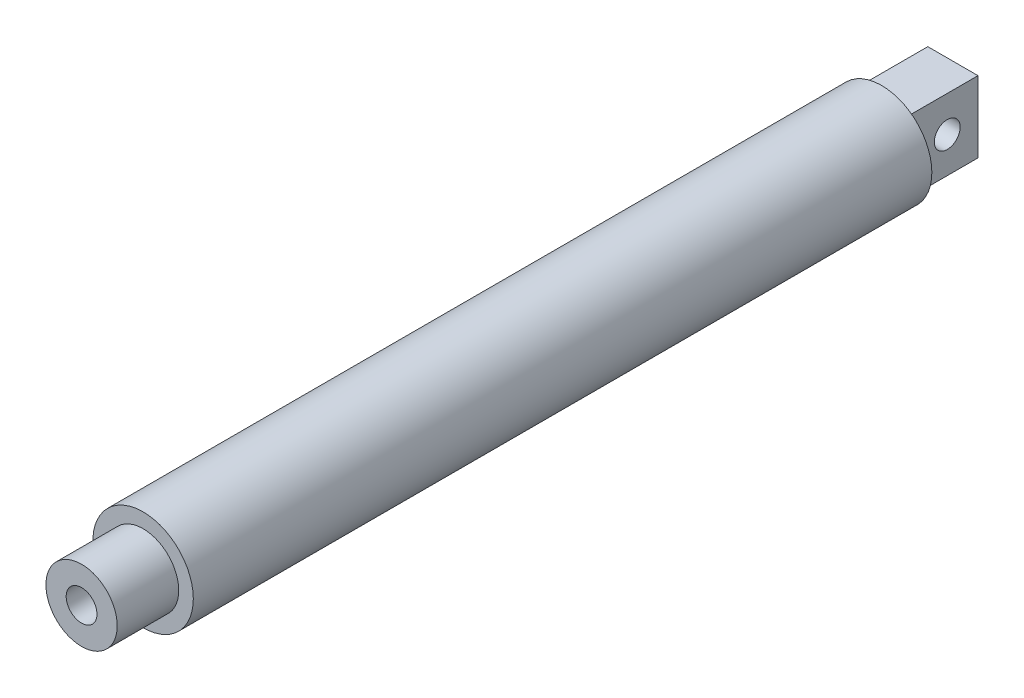
ISO-10303-21;
HEADER;
FILE_DESCRIPTION(('STEP AP214'),'2;1');
FILE_NAME('part.step','',(''),(''),'','','');
FILE_SCHEMA(('AUTOMOTIVE_DESIGN { 1 0 10303 214 1 1 1 1 }'));
ENDSEC;
DATA;
#1=APPLICATION_CONTEXT('core data for automotive mechanical design processes');
#2=APPLICATION_PROTOCOL_DEFINITION('international standard','automotive_design',2000,#1);
#3=PRODUCT_CONTEXT('',#1,'mechanical');
#4=PRODUCT('Part','Part','',(#3));
#5=PRODUCT_RELATED_PRODUCT_CATEGORY('part','',(#4));
#6=PRODUCT_DEFINITION_FORMATION('','',#4);
#7=PRODUCT_DEFINITION_CONTEXT('part definition',#1,'design');
#8=PRODUCT_DEFINITION('design','',#6,#7);
#9=PRODUCT_DEFINITION_SHAPE('','',#8);
#10=(LENGTH_UNIT() NAMED_UNIT(*) SI_UNIT(.MILLI.,.METRE.));
#11=(NAMED_UNIT(*) PLANE_ANGLE_UNIT() SI_UNIT($,.RADIAN.));
#12=(NAMED_UNIT(*) SI_UNIT($,.STERADIAN.) SOLID_ANGLE_UNIT());
#13=UNCERTAINTY_MEASURE_WITH_UNIT(LENGTH_MEASURE(1.E-05),#10,'distance_accuracy_value','');
#14=(GEOMETRIC_REPRESENTATION_CONTEXT(3) GLOBAL_UNCERTAINTY_ASSIGNED_CONTEXT((#13)) GLOBAL_UNIT_ASSIGNED_CONTEXT((#10,
#11,#12)) REPRESENTATION_CONTEXT('',''));
#15=CARTESIAN_POINT('',(0.,0.,0.));
#16=DIRECTION('',(0.,0.,1.));
#17=DIRECTION('',(1.,0.,0.));
#18=AXIS2_PLACEMENT_3D('',#15,#16,#17);
#19=CARTESIAN_POINT('',(0.,0.,0.));
#20=DIRECTION('',(0.,0.,1.));
#21=DIRECTION('',(1.,0.,0.));
#22=AXIS2_PLACEMENT_3D('',#19,#20,#21);
#23=PLANE('',#22);
#24=CARTESIAN_POINT('',(0.,0.,0.));
#25=DIRECTION('',(0.,0.,1.));
#26=DIRECTION('',(1.,0.,0.));
#27=AXIS2_PLACEMENT_3D('',#24,#25,#26);
#28=CIRCLE('',#27,7.874);
#29=CARTESIAN_POINT('',(7.874,0.,0.));
#30=VERTEX_POINT('',#29);
#31=EDGE_CURVE('E36',#30,#30,#28,.T.);
#32=ORIENTED_EDGE('',*,*,#31,.F.);
#33=EDGE_LOOP('',(#32));
#34=FACE_BOUND('',#33,.T.);
#35=DIRECTION('',(0.,1.,0.));
#36=VECTOR('',#35,1.);
#37=CARTESIAN_POINT('',(-3.937,-5.588,0.));
#38=LINE('',#37,#36);
#39=CARTESIAN_POINT('',(-3.937,-5.588,0.));
#40=VERTEX_POINT('',#39);
#41=CARTESIAN_POINT('',(-3.937,5.588,0.));
#42=VERTEX_POINT('',#41);
#43=EDGE_CURVE('E49',#40,#42,#38,.T.);
#44=ORIENTED_EDGE('',*,*,#43,.F.);
#45=DIRECTION('',(-1.,0.,0.));
#46=VECTOR('',#45,1.);
#47=CARTESIAN_POINT('',(3.937,-5.588,0.));
#48=LINE('',#47,#46);
#49=CARTESIAN_POINT('',(3.937,-5.588,0.));
#50=VERTEX_POINT('',#49);
#51=EDGE_CURVE('E53',#50,#40,#48,.T.);
#52=ORIENTED_EDGE('',*,*,#51,.F.);
#53=DIRECTION('',(0.,-1.,0.));
#54=VECTOR('',#53,1.);
#55=CARTESIAN_POINT('',(3.937,-5.588,0.));
#56=LINE('',#55,#54);
#57=CARTESIAN_POINT('',(3.937,5.588,0.));
#58=VERTEX_POINT('',#57);
#59=EDGE_CURVE('E175',#58,#50,#56,.T.);
#60=ORIENTED_EDGE('',*,*,#59,.F.);
#61=DIRECTION('',(1.,0.,0.));
#62=VECTOR('',#61,1.);
#63=CARTESIAN_POINT('',(3.937,5.588,0.));
#64=LINE('',#63,#62);
#65=EDGE_CURVE('E173',#42,#58,#64,.T.);
#66=ORIENTED_EDGE('',*,*,#65,.F.);
#67=EDGE_LOOP('',(#44,#52,#60,#66));
#68=FACE_BOUND('',#67,.T.);
#69=ADVANCED_FACE('F32',(#34,#68),#23,.F.);
#70=CARTESIAN_POINT('',(0.,0.,115.824));
#71=DIRECTION('',(0.,0.,-1.));
#72=DIRECTION('',(-1.,0.,0.));
#73=AXIS2_PLACEMENT_3D('',#70,#71,#72);
#74=CYLINDRICAL_SURFACE('',#73,7.874);
#75=CARTESIAN_POINT('',(0.,0.,115.824));
#76=DIRECTION('',(0.,0.,1.));
#77=DIRECTION('',(1.,0.,0.));
#78=AXIS2_PLACEMENT_3D('',#75,#76,#77);
#79=CIRCLE('',#78,7.874);
#80=CARTESIAN_POINT('',(7.874,0.,115.824));
#81=VERTEX_POINT('',#80);
#82=EDGE_CURVE('E41',#81,#81,#79,.T.);
#83=ORIENTED_EDGE('',*,*,#82,.F.);
#84=EDGE_LOOP('',(#83));
#85=FACE_BOUND('',#84,.T.);
#86=ORIENTED_EDGE('',*,*,#31,.T.);
#87=EDGE_LOOP('',(#86));
#88=FACE_BOUND('',#87,.T.);
#89=ADVANCED_FACE('F34',(#85,#88),#74,.T.);
#90=CARTESIAN_POINT('',(0.,0.,115.824));
#91=DIRECTION('',(0.,0.,1.));
#92=DIRECTION('',(1.,0.,0.));
#93=AXIS2_PLACEMENT_3D('',#90,#91,#92);
#94=PLANE('',#93);
#95=CARTESIAN_POINT('',(0.,0.,115.824));
#96=DIRECTION('',(0.,0.,1.));
#97=DIRECTION('',(1.,0.,0.));
#98=AXIS2_PLACEMENT_3D('',#95,#96,#97);
#99=CIRCLE('',#98,5.588);
#100=CARTESIAN_POINT('',(5.588,0.,115.824));
#101=VERTEX_POINT('',#100);
#102=EDGE_CURVE('E11',#101,#101,#99,.T.);
#103=ORIENTED_EDGE('',*,*,#102,.F.);
#104=EDGE_LOOP('',(#103));
#105=FACE_BOUND('',#104,.T.);
#106=ORIENTED_EDGE('',*,*,#82,.T.);
#107=EDGE_LOOP('',(#106));
#108=FACE_BOUND('',#107,.T.);
#109=ADVANCED_FACE('F113',(#105,#108),#94,.T.);
#110=CARTESIAN_POINT('',(0.,0.,125.476));
#111=DIRECTION('',(0.,0.,-1.));
#112=DIRECTION('',(-1.,0.,0.));
#113=AXIS2_PLACEMENT_3D('',#110,#111,#112);
#114=CYLINDRICAL_SURFACE('',#113,5.588);
#115=CARTESIAN_POINT('',(0.,0.,125.476));
#116=DIRECTION('',(0.,0.,1.));
#117=DIRECTION('',(1.,0.,0.));
#118=AXIS2_PLACEMENT_3D('',#115,#116,#117);
#119=CIRCLE('',#118,5.588);
#120=CARTESIAN_POINT('',(5.588,0.,125.476));
#121=VERTEX_POINT('',#120);
#122=EDGE_CURVE('E95',#121,#121,#119,.T.);
#123=ORIENTED_EDGE('',*,*,#122,.F.);
#124=EDGE_LOOP('',(#123));
#125=FACE_BOUND('',#124,.T.);
#126=ORIENTED_EDGE('',*,*,#102,.T.);
#127=EDGE_LOOP('',(#126));
#128=FACE_BOUND('',#127,.T.);
#129=ADVANCED_FACE('F118',(#125,#128),#114,.T.);
#130=CARTESIAN_POINT('',(0.,0.,125.476));
#131=DIRECTION('',(0.,0.,1.));
#132=DIRECTION('',(1.,0.,0.));
#133=AXIS2_PLACEMENT_3D('',#130,#131,#132);
#134=PLANE('',#133);
#135=CARTESIAN_POINT('',(0.,0.,125.476));
#136=DIRECTION('',(0.,0.,1.));
#137=DIRECTION('',(1.,0.,0.));
#138=AXIS2_PLACEMENT_3D('',#135,#136,#137);
#139=CIRCLE('',#138,2.413);
#140=CARTESIAN_POINT('',(2.413,0.,125.476));
#141=VERTEX_POINT('',#140);
#142=EDGE_CURVE('E159',#141,#141,#139,.T.);
#143=ORIENTED_EDGE('',*,*,#142,.F.);
#144=EDGE_LOOP('',(#143));
#145=FACE_BOUND('',#144,.T.);
#146=ORIENTED_EDGE('',*,*,#122,.T.);
#147=EDGE_LOOP('',(#146));
#148=FACE_BOUND('',#147,.T.);
#149=ADVANCED_FACE('F122',(#145,#148),#134,.T.);
#150=CARTESIAN_POINT('',(-3.937,-5.588,-11.176));
#151=DIRECTION('',(1.,0.,0.));
#152=DIRECTION('',(0.,0.,-1.));
#153=AXIS2_PLACEMENT_3D('',#150,#151,#152);
#154=PLANE('',#153);
#155=CARTESIAN_POINT('',(-3.937,0.,-6.35));
#156=DIRECTION('',(1.,0.,0.));
#157=DIRECTION('',(0.,0.,-1.));
#158=AXIS2_PLACEMENT_3D('',#155,#156,#157);
#159=CIRCLE('',#158,2.032);
#160=CARTESIAN_POINT('',(-3.937,0.,-8.382));
#161=VERTEX_POINT('',#160);
#162=EDGE_CURVE('E162',#161,#161,#159,.T.);
#163=ORIENTED_EDGE('',*,*,#162,.T.);
#164=EDGE_LOOP('',(#163));
#165=FACE_BOUND('',#164,.T.);
#166=ORIENTED_EDGE('',*,*,#43,.T.);
#167=DIRECTION('',(0.,0.,1.));
#168=VECTOR('',#167,1.);
#169=CARTESIAN_POINT('',(-3.937,5.588,-11.176));
#170=LINE('',#169,#168);
#171=CARTESIAN_POINT('',(-3.937,5.588,-11.176));
#172=VERTEX_POINT('',#171);
#173=EDGE_CURVE('E78',#172,#42,#170,.T.);
#174=ORIENTED_EDGE('',*,*,#173,.F.);
#175=DIRECTION('',(0.,1.,0.));
#176=VECTOR('',#175,1.);
#177=CARTESIAN_POINT('',(-3.937,-5.588,-11.176));
#178=LINE('',#177,#176);
#179=CARTESIAN_POINT('',(-3.937,-5.588,-11.176));
#180=VERTEX_POINT('',#179);
#181=EDGE_CURVE('E84',#180,#172,#178,.T.);
#182=ORIENTED_EDGE('',*,*,#181,.F.);
#183=DIRECTION('',(0.,0.,1.));
#184=VECTOR('',#183,1.);
#185=CARTESIAN_POINT('',(-3.937,-5.588,-11.176));
#186=LINE('',#185,#184);
#187=EDGE_CURVE('E171',#180,#40,#186,.T.);
#188=ORIENTED_EDGE('',*,*,#187,.T.);
#189=EDGE_LOOP('',(#166,#174,#182,#188));
#190=FACE_BOUND('',#189,.T.);
#191=ADVANCED_FACE('F94',(#165,#190),#154,.F.);
#192=CARTESIAN_POINT('',(3.937,5.588,-11.176));
#193=DIRECTION('',(0.,-1.,0.));
#194=DIRECTION('',(0.,0.,-1.));
#195=AXIS2_PLACEMENT_3D('',#192,#193,#194);
#196=PLANE('',#195);
#197=ORIENTED_EDGE('',*,*,#65,.T.);
#198=DIRECTION('',(0.,0.,1.));
#199=VECTOR('',#198,1.);
#200=CARTESIAN_POINT('',(3.937,5.588,-11.176));
#201=LINE('',#200,#199);
#202=CARTESIAN_POINT('',(3.937,5.588,-11.176));
#203=VERTEX_POINT('',#202);
#204=EDGE_CURVE('E80',#203,#58,#201,.T.);
#205=ORIENTED_EDGE('',*,*,#204,.F.);
#206=DIRECTION('',(1.,0.,0.));
#207=VECTOR('',#206,1.);
#208=CARTESIAN_POINT('',(3.937,5.588,-11.176));
#209=LINE('',#208,#207);
#210=EDGE_CURVE('E73',#172,#203,#209,.T.);
#211=ORIENTED_EDGE('',*,*,#210,.F.);
#212=ORIENTED_EDGE('',*,*,#173,.T.);
#213=EDGE_LOOP('',(#197,#205,#211,#212));
#214=FACE_BOUND('',#213,.T.);
#215=ADVANCED_FACE('F76',(#214),#196,.F.);
#216=CARTESIAN_POINT('',(3.937,-5.588,-11.176));
#217=DIRECTION('',(-1.,0.,0.));
#218=DIRECTION('',(0.,0.,1.));
#219=AXIS2_PLACEMENT_3D('',#216,#217,#218);
#220=PLANE('',#219);
#221=CARTESIAN_POINT('',(3.937,0.,-6.35));
#222=DIRECTION('',(1.,0.,0.));
#223=DIRECTION('',(0.,0.,-1.));
#224=AXIS2_PLACEMENT_3D('',#221,#222,#223);
#225=CIRCLE('',#224,2.032);
#226=CARTESIAN_POINT('',(3.937,0.,-8.382));
#227=VERTEX_POINT('',#226);
#228=EDGE_CURVE('E158',#227,#227,#225,.T.);
#229=ORIENTED_EDGE('',*,*,#228,.F.);
#230=EDGE_LOOP('',(#229));
#231=FACE_BOUND('',#230,.T.);
#232=ORIENTED_EDGE('',*,*,#59,.T.);
#233=DIRECTION('',(0.,0.,1.));
#234=VECTOR('',#233,1.);
#235=CARTESIAN_POINT('',(3.937,-5.588,-11.176));
#236=LINE('',#235,#234);
#237=CARTESIAN_POINT('',(3.937,-5.588,-11.176));
#238=VERTEX_POINT('',#237);
#239=EDGE_CURVE('E99',#238,#50,#236,.T.);
#240=ORIENTED_EDGE('',*,*,#239,.F.);
#241=DIRECTION('',(0.,-1.,0.));
#242=VECTOR('',#241,1.);
#243=CARTESIAN_POINT('',(3.937,-5.588,-11.176));
#244=LINE('',#243,#242);
#245=EDGE_CURVE('E83',#203,#238,#244,.T.);
#246=ORIENTED_EDGE('',*,*,#245,.F.);
#247=ORIENTED_EDGE('',*,*,#204,.T.);
#248=EDGE_LOOP('',(#232,#240,#246,#247));
#249=FACE_BOUND('',#248,.T.);
#250=ADVANCED_FACE('F132',(#231,#249),#220,.F.);
#251=CARTESIAN_POINT('',(3.937,-5.588,-11.176));
#252=DIRECTION('',(0.,1.,0.));
#253=DIRECTION('',(0.,0.,1.));
#254=AXIS2_PLACEMENT_3D('',#251,#252,#253);
#255=PLANE('',#254);
#256=ORIENTED_EDGE('',*,*,#51,.T.);
#257=ORIENTED_EDGE('',*,*,#187,.F.);
#258=DIRECTION('',(-1.,0.,0.));
#259=VECTOR('',#258,1.);
#260=CARTESIAN_POINT('',(3.937,-5.588,-11.176));
#261=LINE('',#260,#259);
#262=EDGE_CURVE('E89',#238,#180,#261,.T.);
#263=ORIENTED_EDGE('',*,*,#262,.F.);
#264=ORIENTED_EDGE('',*,*,#239,.T.);
#265=EDGE_LOOP('',(#256,#257,#263,#264));
#266=FACE_BOUND('',#265,.T.);
#267=ADVANCED_FACE('F135',(#266),#255,.F.);
#268=CARTESIAN_POINT('',(0.,0.,-11.176));
#269=DIRECTION('',(0.,0.,1.));
#270=DIRECTION('',(1.,0.,0.));
#271=AXIS2_PLACEMENT_3D('',#268,#269,#270);
#272=PLANE('',#271);
#273=ORIENTED_EDGE('',*,*,#181,.T.);
#274=ORIENTED_EDGE('',*,*,#210,.T.);
#275=ORIENTED_EDGE('',*,*,#245,.T.);
#276=ORIENTED_EDGE('',*,*,#262,.T.);
#277=EDGE_LOOP('',(#273,#274,#275,#276));
#278=FACE_BOUND('',#277,.T.);
#279=ADVANCED_FACE('F87',(#278),#272,.F.);
#280=CARTESIAN_POINT('',(-7.874,0.,-6.35));
#281=DIRECTION('',(1.,0.,0.));
#282=DIRECTION('',(0.,0.,-1.));
#283=AXIS2_PLACEMENT_3D('',#280,#281,#282);
#284=CYLINDRICAL_SURFACE('',#283,2.032);
#285=ORIENTED_EDGE('',*,*,#228,.T.);
#286=EDGE_LOOP('',(#285));
#287=FACE_BOUND('',#286,.T.);
#288=ORIENTED_EDGE('',*,*,#162,.F.);
#289=EDGE_LOOP('',(#288));
#290=FACE_BOUND('',#289,.T.);
#291=ADVANCED_FACE('F142',(#287,#290),#284,.F.);
#292=CARTESIAN_POINT('',(0.,0.,11.176));
#293=DIRECTION('',(0.,0.,1.));
#294=DIRECTION('',(1.,0.,0.));
#295=AXIS2_PLACEMENT_3D('',#292,#293,#294);
#296=CYLINDRICAL_SURFACE('',#295,2.413);
#297=CARTESIAN_POINT('',(0.,0.,11.176));
#298=DIRECTION('',(0.,0.,1.));
#299=DIRECTION('',(1.,0.,0.));
#300=AXIS2_PLACEMENT_3D('',#297,#298,#299);
#301=CIRCLE('',#300,2.413);
#302=CARTESIAN_POINT('',(2.413,0.,11.176));
#303=VERTEX_POINT('',#302);
#304=EDGE_CURVE('E157',#303,#303,#301,.T.);
#305=ORIENTED_EDGE('',*,*,#304,.F.);
#306=EDGE_LOOP('',(#305));
#307=FACE_BOUND('',#306,.T.);
#308=ORIENTED_EDGE('',*,*,#142,.T.);
#309=EDGE_LOOP('',(#308));
#310=FACE_BOUND('',#309,.T.);
#311=ADVANCED_FACE('F145',(#307,#310),#296,.F.);
#312=CARTESIAN_POINT('',(0.,0.,11.176));
#313=DIRECTION('',(0.,0.,1.));
#314=DIRECTION('',(1.,0.,0.));
#315=AXIS2_PLACEMENT_3D('',#312,#313,#314);
#316=PLANE('',#315);
#317=ORIENTED_EDGE('',*,*,#304,.T.);
#318=EDGE_LOOP('',(#317));
#319=FACE_BOUND('',#318,.T.);
#320=ADVANCED_FACE('F149',(#319),#316,.T.);
#321=CLOSED_SHELL('',(#69,#89,#109,#129,#149,#191,#215,#250,#267,#279,#291,#311,#320));
#322=MANIFOLD_SOLID_BREP('B2',#321);
#323=ADVANCED_BREP_SHAPE_REPRESENTATION('',(#18,#322),#14);
#324=SHAPE_DEFINITION_REPRESENTATION(#9,#323);
ENDSEC;
END-ISO-10303-21;
